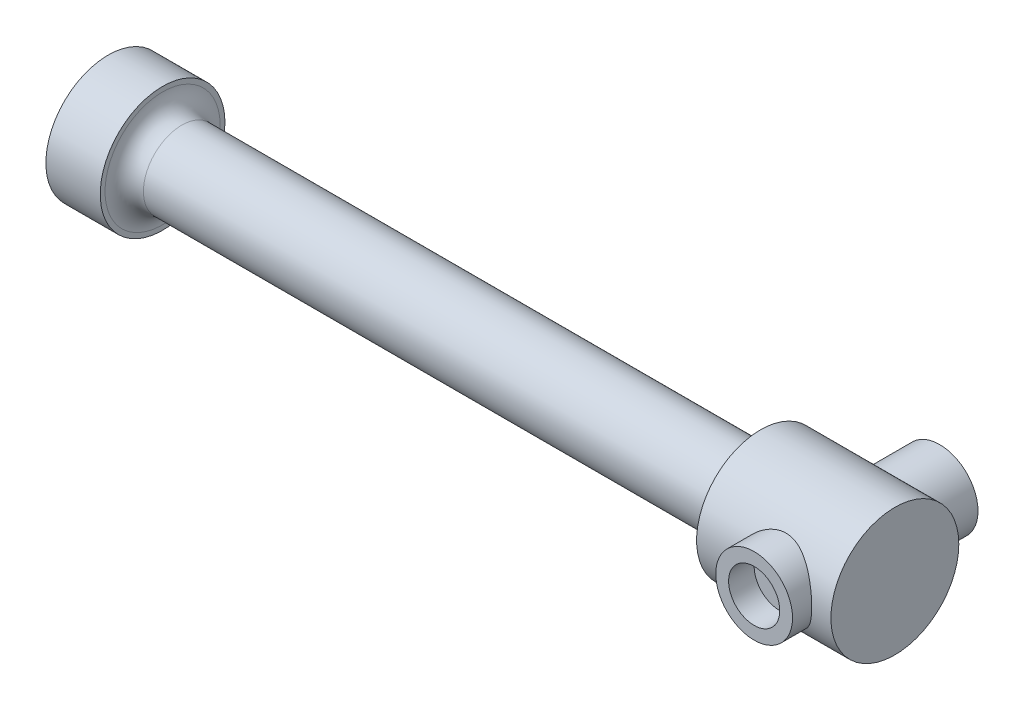
ISO-10303-21;
HEADER;
FILE_DESCRIPTION(('STEP AP214'),'2;1');
FILE_NAME('part.step','',(''),(''),'','','');
FILE_SCHEMA(('AUTOMOTIVE_DESIGN { 1 0 10303 214 1 1 1 1 }'));
ENDSEC;
DATA;
#1=APPLICATION_CONTEXT('core data for automotive mechanical design processes');
#2=APPLICATION_PROTOCOL_DEFINITION('international standard','automotive_design',2000,#1);
#3=PRODUCT_CONTEXT('',#1,'mechanical');
#4=PRODUCT('Part','Part','',(#3));
#5=PRODUCT_RELATED_PRODUCT_CATEGORY('part','',(#4));
#6=PRODUCT_DEFINITION_FORMATION('','',#4);
#7=PRODUCT_DEFINITION_CONTEXT('part definition',#1,'design');
#8=PRODUCT_DEFINITION('design','',#6,#7);
#9=PRODUCT_DEFINITION_SHAPE('','',#8);
#10=(LENGTH_UNIT() NAMED_UNIT(*) SI_UNIT(.MILLI.,.METRE.));
#11=(NAMED_UNIT(*) PLANE_ANGLE_UNIT() SI_UNIT($,.RADIAN.));
#12=(NAMED_UNIT(*) SI_UNIT($,.STERADIAN.) SOLID_ANGLE_UNIT());
#13=UNCERTAINTY_MEASURE_WITH_UNIT(LENGTH_MEASURE(1.E-05),#10,'distance_accuracy_value','');
#14=(GEOMETRIC_REPRESENTATION_CONTEXT(3) GLOBAL_UNCERTAINTY_ASSIGNED_CONTEXT((#13)) GLOBAL_UNIT_ASSIGNED_CONTEXT((#10,
#11,#12)) REPRESENTATION_CONTEXT('',''));
#15=CARTESIAN_POINT('',(0.,0.,0.));
#16=DIRECTION('',(0.,0.,1.));
#17=DIRECTION('',(1.,0.,0.));
#18=AXIS2_PLACEMENT_3D('',#15,#16,#17);
#19=CARTESIAN_POINT('',(114.,0.,-16.001));
#20=DIRECTION('',(0.,0.,1.));
#21=DIRECTION('',(1.,0.,0.));
#22=AXIS2_PLACEMENT_3D('',#19,#20,#21);
#23=CYLINDRICAL_SURFACE('',#22,1.5);
#24=CARTESIAN_POINT('',(114.,0.,9.));
#25=DIRECTION('',(0.,0.,1.));
#26=DIRECTION('',(1.,0.,0.));
#27=AXIS2_PLACEMENT_3D('',#24,#25,#26);
#28=CIRCLE('',#27,1.5);
#29=CARTESIAN_POINT('',(115.5,0.,9.));
#30=VERTEX_POINT('',#29);
#31=EDGE_CURVE('E285',#30,#30,#28,.T.);
#32=ORIENTED_EDGE('',*,*,#31,.T.);
#33=EDGE_LOOP('',(#32));
#34=FACE_BOUND('',#33,.T.);
#35=CARTESIAN_POINT('',(114.,0.,-12.));
#36=DIRECTION('',(0.,0.,-1.));
#37=DIRECTION('',(-1.,0.,0.));
#38=AXIS2_PLACEMENT_3D('',#35,#36,#37);
#39=CIRCLE('',#38,1.5);
#40=CARTESIAN_POINT('',(112.5,0.,-12.));
#41=VERTEX_POINT('',#40);
#42=EDGE_CURVE('E36',#41,#41,#39,.F.);
#43=ORIENTED_EDGE('',*,*,#42,.F.);
#44=EDGE_LOOP('',(#43));
#45=FACE_BOUND('',#44,.T.);
#46=ADVANCED_FACE('F32',(#34,#45),#23,.F.);
#47=CARTESIAN_POINT('',(8.5,0.,0.));
#48=DIRECTION('',(1.,0.,0.));
#49=DIRECTION('',(0.,0.,-1.));
#50=AXIS2_PLACEMENT_3D('',#47,#48,#49);
#51=PLANE('',#50);
#52=CARTESIAN_POINT('',(8.5,0.,0.));
#53=DIRECTION('',(1.,0.,0.));
#54=DIRECTION('',(0.,0.,-1.));
#55=AXIS2_PLACEMENT_3D('',#52,#53,#54);
#56=CIRCLE('',#55,9.);
#57=CARTESIAN_POINT('',(8.5,0.,-9.));
#58=VERTEX_POINT('',#57);
#59=EDGE_CURVE('E45',#58,#58,#56,.F.);
#60=ORIENTED_EDGE('',*,*,#59,.T.);
#61=EDGE_LOOP('',(#60));
#62=FACE_BOUND('',#61,.T.);
#63=CARTESIAN_POINT('',(8.5,0.,0.));
#64=DIRECTION('',(1.,0.,0.));
#65=DIRECTION('',(0.,0.,-1.));
#66=AXIS2_PLACEMENT_3D('',#63,#64,#65);
#67=CIRCLE('',#66,9.75);
#68=CARTESIAN_POINT('',(8.5,0.,-9.75));
#69=VERTEX_POINT('',#68);
#70=EDGE_CURVE('E141',#69,#69,#67,.T.);
#71=ORIENTED_EDGE('',*,*,#70,.T.);
#72=EDGE_LOOP('',(#71));
#73=FACE_BOUND('',#72,.T.);
#74=ADVANCED_FACE('F92',(#62,#73),#51,.T.);
#75=CARTESIAN_POINT('',(8.5,0.,0.));
#76=DIRECTION('',(-1.,0.,0.));
#77=DIRECTION('',(0.,0.,1.));
#78=AXIS2_PLACEMENT_3D('',#75,#76,#77);
#79=CYLINDRICAL_SURFACE('',#78,9.75);
#80=ORIENTED_EDGE('',*,*,#70,.F.);
#81=EDGE_LOOP('',(#80));
#82=FACE_BOUND('',#81,.T.);
#83=CARTESIAN_POINT('',(0.,0.,0.));
#84=DIRECTION('',(1.,0.,0.));
#85=DIRECTION('',(0.,0.,-1.));
#86=AXIS2_PLACEMENT_3D('',#83,#84,#85);
#87=CIRCLE('',#86,9.75);
#88=CARTESIAN_POINT('',(0.,0.,-9.75));
#89=VERTEX_POINT('',#88);
#90=EDGE_CURVE('E137',#89,#89,#87,.T.);
#91=ORIENTED_EDGE('',*,*,#90,.T.);
#92=EDGE_LOOP('',(#91));
#93=FACE_BOUND('',#92,.T.);
#94=ADVANCED_FACE('F98',(#82,#93),#79,.T.);
#95=CARTESIAN_POINT('',(0.,0.,0.));
#96=DIRECTION('',(1.,0.,0.));
#97=DIRECTION('',(0.,0.,-1.));
#98=AXIS2_PLACEMENT_3D('',#95,#96,#97);
#99=PLANE('',#98);
#100=ORIENTED_EDGE('',*,*,#90,.F.);
#101=EDGE_LOOP('',(#100));
#102=FACE_BOUND('',#101,.T.);
#103=ADVANCED_FACE('F155',(#102),#99,.F.);
#104=CARTESIAN_POINT('',(102.,0.,0.));
#105=DIRECTION('',(-1.,0.,0.));
#106=DIRECTION('',(0.,0.,1.));
#107=AXIS2_PLACEMENT_3D('',#104,#105,#106);
#108=CYLINDRICAL_SURFACE('',#107,6.);
#109=CARTESIAN_POINT('',(100.,0.,0.));
#110=DIRECTION('',(1.,0.,0.));
#111=DIRECTION('',(0.,0.,-1.));
#112=AXIS2_PLACEMENT_3D('',#109,#110,#111);
#113=CIRCLE('',#112,6.);
#114=CARTESIAN_POINT('',(100.,0.,-6.));
#115=VERTEX_POINT('',#114);
#116=EDGE_CURVE('E10',#115,#115,#113,.F.);
#117=ORIENTED_EDGE('',*,*,#116,.T.);
#118=EDGE_LOOP('',(#117));
#119=FACE_BOUND('',#118,.T.);
#120=CARTESIAN_POINT('',(11.5,0.,0.));
#121=DIRECTION('',(1.,0.,0.));
#122=DIRECTION('',(0.,0.,-1.));
#123=AXIS2_PLACEMENT_3D('',#120,#121,#122);
#124=CIRCLE('',#123,6.);
#125=CARTESIAN_POINT('',(11.5,0.,-6.));
#126=VERTEX_POINT('',#125);
#127=EDGE_CURVE('E144',#126,#126,#124,.T.);
#128=ORIENTED_EDGE('',*,*,#127,.T.);
#129=EDGE_LOOP('',(#128));
#130=FACE_BOUND('',#129,.T.);
#131=ADVANCED_FACE('F88',(#119,#130),#108,.T.);
#132=CARTESIAN_POINT('',(11.5,0.,0.));
#133=DIRECTION('',(1.,0.,0.));
#134=DIRECTION('',(0.,0.,-1.));
#135=AXIS2_PLACEMENT_3D('',#132,#133,#134);
#136=TOROIDAL_SURFACE('',#135,9.,3.);
#137=ORIENTED_EDGE('',*,*,#59,.F.);
#138=EDGE_LOOP('',(#137));
#139=FACE_BOUND('',#138,.T.);
#140=ORIENTED_EDGE('',*,*,#127,.F.);
#141=EDGE_LOOP('',(#140));
#142=FACE_BOUND('',#141,.T.);
#143=ADVANCED_FACE('F81',(#139,#142),#136,.F.);
#144=CARTESIAN_POINT('',(102.,0.,0.));
#145=DIRECTION('',(1.,0.,0.));
#146=DIRECTION('',(0.,0.,-1.));
#147=AXIS2_PLACEMENT_3D('',#144,#145,#146);
#148=PLANE('',#147);
#149=CARTESIAN_POINT('',(102.,0.,0.));
#150=DIRECTION('',(1.,0.,0.));
#151=DIRECTION('',(0.,0.,-1.));
#152=AXIS2_PLACEMENT_3D('',#149,#150,#151);
#153=CIRCLE('',#152,8.);
#154=CARTESIAN_POINT('',(102.,0.,-8.));
#155=VERTEX_POINT('',#154);
#156=EDGE_CURVE('E40',#155,#155,#153,.T.);
#157=ORIENTED_EDGE('',*,*,#156,.T.);
#158=EDGE_LOOP('',(#157));
#159=FACE_BOUND('',#158,.T.);
#160=CARTESIAN_POINT('',(102.,0.,0.));
#161=DIRECTION('',(1.,0.,0.));
#162=DIRECTION('',(0.,0.,-1.));
#163=AXIS2_PLACEMENT_3D('',#160,#161,#162);
#164=CIRCLE('',#163,10.);
#165=CARTESIAN_POINT('',(102.,0.,-10.));
#166=VERTEX_POINT('',#165);
#167=EDGE_CURVE('E138',#166,#166,#164,.T.);
#168=ORIENTED_EDGE('',*,*,#167,.F.);
#169=EDGE_LOOP('',(#168));
#170=FACE_BOUND('',#169,.T.);
#171=ADVANCED_FACE('F79',(#159,#170),#148,.F.);
#172=CARTESIAN_POINT('',(123.,0.,0.));
#173=DIRECTION('',(-1.,0.,0.));
#174=DIRECTION('',(0.,0.,1.));
#175=AXIS2_PLACEMENT_3D('',#172,#173,#174);
#176=CYLINDRICAL_SURFACE('',#175,10.);
#177=CARTESIAN_POINT('',(120.,0.,10.));
#178=CARTESIAN_POINT('',(119.999998745191,-0.153537444551437,9.99999883168644));
#179=CARTESIAN_POINT('',(119.9940973574,-0.307113729394928,9.99645496091162));
#180=CARTESIAN_POINT('',(119.970566986841,-0.613107521326879,9.98236364463673));
#181=CARTESIAN_POINT('',(119.952931142188,-0.76552429760002,9.97181210130936));
#182=CARTESIAN_POINT('',(119.906127895651,-1.06824745150987,9.94394249918953));
#183=CARTESIAN_POINT('',(119.876938661774,-1.21854927251923,9.926611630499));
#184=CARTESIAN_POINT('',(119.807400061742,-1.51572002727398,9.88560105277181));
#185=CARTESIAN_POINT('',(119.767045930178,-1.66258746605991,9.86191863289495));
#186=CARTESIAN_POINT('',(119.675912399103,-1.95109561530948,9.80890481966906));
#187=CARTESIAN_POINT('',(119.62519085957,-2.09276039690219,9.77960483164848));
#188=CARTESIAN_POINT('',(119.513725630889,-2.37093083799643,9.7159192851634));
#189=CARTESIAN_POINT('',(119.452978069542,-2.50743447905545,9.68153176235135));
#190=CARTESIAN_POINT('',(119.256615921481,-2.90796291658618,9.57184162303338));
#191=CARTESIAN_POINT('',(119.106765140666,-3.1633697760085,9.4899416782257));
#192=CARTESIAN_POINT('',(118.760891856919,-3.66523770071095,9.30821070093225));
#193=CARTESIAN_POINT('',(118.562214867513,-3.90952112480153,9.20748739861886));
#194=CARTESIAN_POINT('',(118.130101497822,-4.36354579042122,9.00120183744764));
#195=CARTESIAN_POINT('',(117.896620567373,-4.57324202374219,8.89563349844521));
#196=CARTESIAN_POINT('',(117.508001002179,-4.87082578782842,8.73441166956493));
#197=CARTESIAN_POINT('',(117.363367381755,-4.97182330842635,8.67715724472595));
#198=CARTESIAN_POINT('',(117.064805642624,-5.16122122731058,8.56585317782531));
#199=CARTESIAN_POINT('',(116.910875994797,-5.24961954505302,8.511804065925));
#200=CARTESIAN_POINT('',(116.594622317587,-5.41290775237596,8.40890843735161));
#201=CARTESIAN_POINT('',(116.432309612332,-5.48781528185459,8.36005516160798));
#202=CARTESIAN_POINT('',(116.099941829181,-5.62338163354011,8.26947589323735));
#203=CARTESIAN_POINT('',(115.929889668991,-5.68404577312335,8.22774724242061));
#204=CARTESIAN_POINT('',(115.625079920862,-5.77737221892758,8.16237611554734));
#205=CARTESIAN_POINT('',(115.491716651134,-5.8132588951073,8.13679954295732));
#206=CARTESIAN_POINT('',(115.221870482181,-5.87590039350671,8.09168021123358));
#207=CARTESIAN_POINT('',(115.085388281244,-5.90265723881365,8.07213611544971));
#208=CARTESIAN_POINT('',(114.810251714021,-5.94666970539668,8.03976789878061));
#209=CARTESIAN_POINT('',(114.671599731358,-5.9639350903157,8.02693687297642));
#210=CARTESIAN_POINT('',(114.392944984699,-5.9887526638035,8.00843825390027));
#211=CARTESIAN_POINT('',(114.252942197494,-5.99630468517717,8.00277078393386));
#212=CARTESIAN_POINT('',(113.972369514264,-6.00157990771218,7.99881555301096));
#213=CARTESIAN_POINT('',(113.831799044393,-5.99928372966397,8.00054234240933));
#214=CARTESIAN_POINT('',(113.551452631554,-5.98485668610316,8.01134007353734));
#215=CARTESIAN_POINT('',(113.41167669245,-5.97272577280601,8.02041105095058));
#216=CARTESIAN_POINT('',(113.133876805591,-5.93880584038254,8.04555965197211));
#217=CARTESIAN_POINT('',(112.995853676696,-5.91701246647433,8.06164043478003));
#218=CARTESIAN_POINT('',(112.722505408924,-5.86407894147697,8.10022471868288));
#219=CARTESIAN_POINT('',(112.587181396816,-5.83293497053064,8.12273084444056));
#220=CARTESIAN_POINT('',(112.190039218444,-5.7269806380151,8.19812127089691));
#221=CARTESIAN_POINT('',(111.933129362913,-5.63915194131273,8.25926888138427));
#222=CARTESIAN_POINT('',(111.437182443319,-5.43180047493028,8.39708163578851));
#223=CARTESIAN_POINT('',(111.19815197252,-5.31226608650176,8.47375246584326));
#224=CARTESIAN_POINT('',(110.700051973396,-5.02070076963739,8.65022234735539));
#225=CARTESIAN_POINT('',(110.444785119534,-4.84314550121072,8.75172142070218));
#226=CARTESIAN_POINT('',(110.085230823983,-4.54957124280612,8.90582410728344));
#227=CARTESIAN_POINT('',(109.969189776868,-4.44708318574261,8.95754136048025));
#228=CARTESIAN_POINT('',(109.745217586189,-4.23329437801549,9.06053415675082));
#229=CARTESIAN_POINT('',(109.637287889964,-4.12199206183187,9.11180961955592));
#230=CARTESIAN_POINT('',(109.415562196611,-3.87481857478412,9.21989326570381));
#231=CARTESIAN_POINT('',(109.303055390159,-3.73768795265441,9.27647282365172));
#232=CARTESIAN_POINT('',(109.090073335409,-3.45314122942453,9.38610941141658));
#233=CARTESIAN_POINT('',(108.989593417424,-3.30572915572596,9.43916780480959));
#234=CARTESIAN_POINT('',(108.801519489967,-3.00130059968161,9.54033102133581));
#235=CARTESIAN_POINT('',(108.713923953926,-2.84428525827774,9.58843643110623));
#236=CARTESIAN_POINT('',(108.552589758162,-2.52155783578282,9.67831544597726));
#237=CARTESIAN_POINT('',(108.47884937857,-2.35584683737316,9.72008983683586));
#238=CARTESIAN_POINT('',(108.350395779526,-2.02757278212966,9.79364255267099));
#239=CARTESIAN_POINT('',(108.294776852394,-1.86546851518059,9.82588466787389));
#240=CARTESIAN_POINT('',(108.197354045748,-1.53584722067878,9.88276955471718));
#241=CARTESIAN_POINT('',(108.15554976973,-1.36833034862805,9.90741254446339));
#242=CARTESIAN_POINT('',(108.086455507211,-1.02949369065076,9.94832818480364));
#243=CARTESIAN_POINT('',(108.059151054434,-0.858177873374311,9.96460917751309));
#244=CARTESIAN_POINT('',(108.01947106463,-0.513226306032294,9.9883166876579));
#245=CARTESIAN_POINT('',(108.007093427881,-0.339590885735249,9.99574445045558));
#246=CARTESIAN_POINT('',(107.998136179932,-0.015428594246427,10.0011181661532));
#247=CARTESIAN_POINT('',(107.999637405943,0.135030316693078,10.0002160020556));
#248=CARTESIAN_POINT('',(108.013919562041,0.435218261170644,9.99165275901541));
#249=CARTESIAN_POINT('',(108.026700120559,0.584947318588576,9.98399190272153));
#250=CARTESIAN_POINT('',(108.063367363032,0.882536056591296,9.96209775285793));
#251=CARTESIAN_POINT('',(108.087253288556,1.03039586412686,9.94786490811761));
#252=CARTESIAN_POINT('',(108.145821548111,1.32321247217726,9.913165472997));
#253=CARTESIAN_POINT('',(108.180504150208,1.46816920051815,9.89269872783916));
#254=CARTESIAN_POINT('',(108.259272160967,1.75071908629022,9.84657104453397));
#255=CARTESIAN_POINT('',(108.303105141372,1.88840566825772,9.82105034214295));
#256=CARTESIAN_POINT('',(108.400198532975,2.15939029274506,9.76505054291718));
#257=CARTESIAN_POINT('',(108.453461981776,2.29268690477589,9.73456984870001));
#258=CARTESIAN_POINT('',(108.626663243989,2.6849253601121,9.6365771020272));
#259=CARTESIAN_POINT('',(108.760070479651,2.93642286384019,9.56247925125989));
#260=CARTESIAN_POINT('',(109.074235119669,3.44006129431898,9.39381699318939));
#261=CARTESIAN_POINT('',(109.258469262826,3.6895614151548,9.29792673244944));
#262=CARTESIAN_POINT('',(109.66159165795,4.15611932969619,9.09895598301211));
#263=CARTESIAN_POINT('',(109.880520236191,4.37313879233219,8.99586720626164));
#264=CARTESIAN_POINT('',(110.24723481991,4.68476192706762,8.83567180051124));
#265=CARTESIAN_POINT('',(110.384610416055,4.79158950335552,8.77804452474304));
#266=CARTESIAN_POINT('',(110.668777374529,4.99332637800022,8.66487441639237));
#267=CARTESIAN_POINT('',(110.81557115637,5.08823259511327,8.60933212529391));
#268=CARTESIAN_POINT('',(111.117846869394,5.26534568264162,8.50216742436207));
#269=CARTESIAN_POINT('',(111.273322897011,5.34756104251848,8.45054240595252));
#270=CARTESIAN_POINT('',(111.592308684127,5.49855628026275,8.35308038859148));
#271=CARTESIAN_POINT('',(111.755812655853,5.56734566466804,8.30723930239864));
#272=CARTESIAN_POINT('',(112.053963002338,5.67736385859907,8.23231224945508));
#273=CARTESIAN_POINT('',(112.187229386013,5.72133709184488,8.20174483337219));
#274=CARTESIAN_POINT('',(112.457553736731,5.80005690886224,8.14626667510692));
#275=CARTESIAN_POINT('',(112.59460966938,5.83480834103845,8.12135296146618));
#276=CARTESIAN_POINT('',(112.871688404292,5.8946568885387,8.07801879862436));
#277=CARTESIAN_POINT('',(113.011708139346,5.91976351478428,8.05959195410913));
#278=CARTESIAN_POINT('',(113.293932521359,5.9600153732825,8.02987210085862));
#279=CARTESIAN_POINT('',(113.436137181068,5.97516054737435,8.01857913377509));
#280=CARTESIAN_POINT('',(113.722213824173,5.99528753337017,8.0035422228399));
#281=CARTESIAN_POINT('',(113.866090097559,6.00023037231476,7.999827227501));
#282=CARTESIAN_POINT('',(114.153815740271,5.99975311757475,8.00018515536029));
#283=CARTESIAN_POINT('',(114.29766510955,5.99433300567701,8.00425809224595));
#284=CARTESIAN_POINT('',(114.584248956659,5.97321593242882,8.02002886262284));
#285=CARTESIAN_POINT('',(114.726982871581,5.9575140835971,8.03173032236349));
#286=CARTESIAN_POINT('',(115.010198154241,5.91607855231599,8.06229956209071));
#287=CARTESIAN_POINT('',(115.150679512675,5.89034482844307,8.08116737166849));
#288=CARTESIAN_POINT('',(115.42172585741,5.83069515235667,8.12430163249588));
#289=CARTESIAN_POINT('',(115.552441159206,5.79723709119027,8.14826151524265));
#290=CARTESIAN_POINT('',(115.810385741413,5.72193802024643,8.2013135481482));
#291=CARTESIAN_POINT('',(115.937613829714,5.68009418342385,8.23040742870394));
#292=CARTESIAN_POINT('',(116.31322746154,5.54256357829889,8.32420030637917));
#293=CARTESIAN_POINT('',(116.555679953471,5.43484692597259,8.39543383966226));
#294=CARTESIAN_POINT('',(117.057312736404,5.17156568978209,8.56052345401851));
#295=CARTESIAN_POINT('',(117.313346125629,5.01119401055784,8.6561736985039));
#296=CARTESIAN_POINT('',(117.797538595375,4.65500060946757,8.85281489413667));
#297=CARTESIAN_POINT('',(118.025674461098,4.45914969547372,8.95381019436587));
#298=CARTESIAN_POINT('',(118.36183660388,4.12370341470835,9.11118672816113));
#299=CARTESIAN_POINT('',(118.48022504267,3.9947869496437,9.16858001952611));
#300=CARTESIAN_POINT('',(118.705753497502,3.72646931290711,9.28086988407214));
#301=CARTESIAN_POINT('',(118.812896949807,3.58707136666572,9.3357672170491));
#302=CARTESIAN_POINT('',(119.015218004567,3.29828675494298,9.44166188164684));
#303=CARTESIAN_POINT('',(119.110387078295,3.14889308474009,9.49265642349905));
#304=CARTESIAN_POINT('',(119.287766851204,2.84096458145434,9.58931425936429));
#305=CARTESIAN_POINT('',(119.369979172956,2.68243089637472,9.63497822073852));
#306=CARTESIAN_POINT('',(119.518207155826,2.36211349400593,9.71838319081371));
#307=CARTESIAN_POINT('',(119.584638495226,2.20057425723904,9.75632252421503));
#308=CARTESIAN_POINT('',(119.703530953194,1.87094026552715,9.82486154361095));
#309=CARTESIAN_POINT('',(119.75599475181,1.70284677529883,9.85546263753239));
#310=CARTESIAN_POINT('',(119.846016943351,1.36200638705991,9.90830915235697));
#311=CARTESIAN_POINT('',(119.883621672215,1.18927577776316,9.93058053649489));
#312=CARTESIAN_POINT('',(119.943489192635,0.840366716144949,9.96616672075865));
#313=CARTESIAN_POINT('',(119.965764761897,0.664191261592111,9.97948898025471));
#314=CARTESIAN_POINT('',(119.986783372373,0.406248020354684,9.99207457493582));
#315=CARTESIAN_POINT('',(119.991736975677,0.325112869232335,9.99504405536016));
#316=CARTESIAN_POINT('',(119.998345679055,0.16265544935751,9.99900711160739));
#317=CARTESIAN_POINT('',(120.000000664708,0.0813331742121601,10.0000006188891));
#318=CARTESIAN_POINT('',(120.,0.,10.));
#319=B_SPLINE_CURVE_WITH_KNOTS('',3,(#177,#178,#179,#180,#181,#182,#183,#184,#185,#186,#187,
#188,#189,#190,#191,#192,#193,#194,#195,#196,#197,#198,#199,#200,#201,#202,#203,#204,#205,#206,
#207,#208,#209,#210,#211,#212,#213,#214,#215,#216,#217,#218,#219,#220,#221,#222,#223,#224,#225,
#226,#227,#228,#229,#230,#231,#232,#233,#234,#235,#236,#237,#238,#239,#240,#241,#242,#243,#244,
#245,#246,#247,#248,#249,#250,#251,#252,#253,#254,#255,#256,#257,#258,#259,#260,#261,#262,#263,
#264,#265,#266,#267,#268,#269,#270,#271,#272,#273,#274,#275,#276,#277,#278,#279,#280,#281,#282,
#283,#284,#285,#286,#287,#288,#289,#290,#291,#292,#293,#294,#295,#296,#297,#298,#299,#300,#301,
#302,#303,#304,#305,#306,#307,#308,#309,#310,#311,#312,#313,#314,#315,#316,#317,#318),
.UNSPECIFIED.,.T.,.F.,(4,2,2,2,2,2,2,2,2,2,2,2,2,2,2,2,2,2,2,2,2,2,2,2,2,2,2,2,2,2,2,2,2,2,2,2,
2,2,2,2,2,2,2,2,2,2,2,2,2,2,2,2,2,2,2,2,2,2,2,2,2,2,2,2,2,2,2,2,2,2,4),(0.,0.460526601189237,
0.921322738666801,1.38299381403058,1.84486224490669,2.30422013956031,2.76375586197537,
3.68167311554442,4.66978395284543,5.65917064091952,6.21499415637781,6.77090935054834,
7.32609229452149,7.88106764554409,8.30201487574484,8.72286876721018,9.14328892216057,
9.56371631366181,9.98497139806241,10.40622852925,10.8276757104407,11.2492952938386,
12.0807558666506,12.9125215553463,13.8897049719634,14.3790534646455,14.8684890673691,
15.4263461011955,15.983985828052,16.5415594312421,17.0990637758594,17.6214641151699,
18.1438494594443,18.6657126431692,19.1875024090024,19.638346895262,20.0891765301004,
20.5399753803935,20.9907854241961,21.4305002375878,21.8703569439357,22.7494233427058,
23.7197001490793,24.6911131196182,25.2405264723239,25.7900815377537,26.3392673739261,
26.8880629256888,27.3185187217206,27.7487477532128,28.1785514321197,28.6083576204496,
29.0398026540948,29.4712484460159,29.9028994771413,30.3345522906549,30.7452488920627,
31.156084182716,31.9773303104338,32.9246646516038,33.8727820243207,34.4248169890477,
34.9766827677429,35.5289394130232,36.0811268442984,36.6165634055116,37.1518971546363,
37.6855481107011,38.2187536985203,38.4626993445495,38.706653452248),.UNSPECIFIED.);
#320=CARTESIAN_POINT('',(120.,0.,10.));
#321=VERTEX_POINT('',#320);
#322=EDGE_CURVE('E56',#321,#321,#319,.T.);
#323=ORIENTED_EDGE('',*,*,#322,.T.);
#324=EDGE_LOOP('',(#323));
#325=FACE_BOUND('',#324,.T.);
#326=CARTESIAN_POINT('',(120.,0.,-10.));
#327=CARTESIAN_POINT('',(119.999998745191,0.153537444551437,-9.99999883168644));
#328=CARTESIAN_POINT('',(119.9940973574,0.307113729394929,-9.99645496091162));
#329=CARTESIAN_POINT('',(119.970566986841,0.613107521326879,-9.98236364463673));
#330=CARTESIAN_POINT('',(119.952931142188,0.76552429760002,-9.97181210130936));
#331=CARTESIAN_POINT('',(119.906127895651,1.06824745150987,-9.94394249918953));
#332=CARTESIAN_POINT('',(119.876938661774,1.21854927251923,-9.926611630499));
#333=CARTESIAN_POINT('',(119.807400061742,1.51572002727398,-9.88560105277181));
#334=CARTESIAN_POINT('',(119.767045930178,1.66258746605991,-9.86191863289495));
#335=CARTESIAN_POINT('',(119.675912399103,1.95109561530948,-9.80890481966906));
#336=CARTESIAN_POINT('',(119.62519085957,2.0927603969022,-9.77960483164847));
#337=CARTESIAN_POINT('',(119.513725630889,2.37093083799643,-9.7159192851634));
#338=CARTESIAN_POINT('',(119.452978069542,2.50743447905546,-9.68153176235135));
#339=CARTESIAN_POINT('',(119.256615921481,2.90796291658619,-9.57184162303337));
#340=CARTESIAN_POINT('',(119.106765140666,3.16336977600851,-9.48994167822569));
#341=CARTESIAN_POINT('',(118.760891856919,3.66523770071096,-9.30821070093225));
#342=CARTESIAN_POINT('',(118.562214867513,3.90952112480153,-9.20748739861886));
#343=CARTESIAN_POINT('',(118.130101497822,4.36354579042122,-9.00120183744764));
#344=CARTESIAN_POINT('',(117.896620567373,4.57324202374219,-8.89563349844521));
#345=CARTESIAN_POINT('',(117.508001002179,4.87082578782842,-8.73441166956493));
#346=CARTESIAN_POINT('',(117.363367381755,4.97182330842636,-8.67715724472595));
#347=CARTESIAN_POINT('',(117.064805642624,5.16122122731059,-8.56585317782531));
#348=CARTESIAN_POINT('',(116.910875994797,5.24961954505302,-8.51180406592499));
#349=CARTESIAN_POINT('',(116.594622317587,5.41290775237596,-8.40890843735162));
#350=CARTESIAN_POINT('',(116.432309612332,5.48781528185458,-8.36005516160798));
#351=CARTESIAN_POINT('',(116.099941829181,5.62338163354011,-8.26947589323735));
#352=CARTESIAN_POINT('',(115.929889668991,5.68404577312335,-8.22774724242061));
#353=CARTESIAN_POINT('',(115.625079920862,5.77737221892758,-8.16237611554734));
#354=CARTESIAN_POINT('',(115.491716651134,5.8132588951073,-8.13679954295732));
#355=CARTESIAN_POINT('',(115.221870482181,5.87590039350671,-8.09168021123358));
#356=CARTESIAN_POINT('',(115.085388281244,5.90265723881365,-8.07213611544971));
#357=CARTESIAN_POINT('',(114.810251714021,5.94666970539668,-8.03976789878061));
#358=CARTESIAN_POINT('',(114.671599731358,5.9639350903157,-8.02693687297642));
#359=CARTESIAN_POINT('',(114.392944984699,5.9887526638035,-8.00843825390027));
#360=CARTESIAN_POINT('',(114.252942197494,5.99630468517717,-8.00277078393386));
#361=CARTESIAN_POINT('',(113.972369514264,6.00157990771218,-7.99881555301096));
#362=CARTESIAN_POINT('',(113.831799044393,5.99928372966397,-8.00054234240933));
#363=CARTESIAN_POINT('',(113.551452631554,5.98485668610316,-8.01134007353734));
#364=CARTESIAN_POINT('',(113.41167669245,5.97272577280601,-8.02041105095058));
#365=CARTESIAN_POINT('',(113.133876805591,5.93880584038254,-8.04555965197211));
#366=CARTESIAN_POINT('',(112.995853676696,5.91701246647433,-8.06164043478003));
#367=CARTESIAN_POINT('',(112.722505408924,5.86407894147697,-8.10022471868288));
#368=CARTESIAN_POINT('',(112.587181396816,5.83293497053064,-8.12273084444056));
#369=CARTESIAN_POINT('',(112.190039218444,5.7269806380151,-8.19812127089691));
#370=CARTESIAN_POINT('',(111.933129362913,5.63915194131273,-8.25926888138427));
#371=CARTESIAN_POINT('',(111.437182443319,5.43180047493028,-8.39708163578851));
#372=CARTESIAN_POINT('',(111.19815197252,5.31226608650176,-8.47375246584326));
#373=CARTESIAN_POINT('',(110.700051973396,5.02070076963739,-8.65022234735539));
#374=CARTESIAN_POINT('',(110.444785119534,4.84314550121072,-8.75172142070218));
#375=CARTESIAN_POINT('',(110.085230823983,4.54957124280612,-8.90582410728344));
#376=CARTESIAN_POINT('',(109.969189776868,4.44708318574261,-8.95754136048025));
#377=CARTESIAN_POINT('',(109.745217586189,4.23329437801549,-9.06053415675082));
#378=CARTESIAN_POINT('',(109.637287889964,4.12199206183187,-9.11180961955592));
#379=CARTESIAN_POINT('',(109.415562196611,3.87481857478412,-9.21989326570381));
#380=CARTESIAN_POINT('',(109.303055390159,3.73768795265441,-9.27647282365172));
#381=CARTESIAN_POINT('',(109.090073335409,3.45314122942453,-9.38610941141658));
#382=CARTESIAN_POINT('',(108.989593417424,3.30572915572596,-9.43916780480959));
#383=CARTESIAN_POINT('',(108.801519489967,3.00130059968161,-9.54033102133581));
#384=CARTESIAN_POINT('',(108.713923953926,2.84428525827774,-9.58843643110622));
#385=CARTESIAN_POINT('',(108.552589758162,2.52155783578282,-9.67831544597726));
#386=CARTESIAN_POINT('',(108.47884937857,2.35584683737316,-9.72008983683586));
#387=CARTESIAN_POINT('',(108.350395779526,2.02757278212966,-9.79364255267099));
#388=CARTESIAN_POINT('',(108.294776852394,1.86546851518059,-9.82588466787389));
#389=CARTESIAN_POINT('',(108.197354045748,1.53584722067877,-9.88276955471718));
#390=CARTESIAN_POINT('',(108.15554976973,1.36833034862805,-9.90741254446339));
#391=CARTESIAN_POINT('',(108.086455507211,1.02949369065076,-9.94832818480364));
#392=CARTESIAN_POINT('',(108.059151054434,0.858177873374309,-9.96460917751309));
#393=CARTESIAN_POINT('',(108.01947106463,0.513226306032293,-9.9883166876579));
#394=CARTESIAN_POINT('',(108.007093427881,0.339590885735247,-9.99574445045557));
#395=CARTESIAN_POINT('',(107.998136179932,0.0154285942464256,-10.0011181661532));
#396=CARTESIAN_POINT('',(107.999637405943,-0.135030316693079,-10.0002160020556));
#397=CARTESIAN_POINT('',(108.013919562041,-0.435218261170645,-9.99165275901541));
#398=CARTESIAN_POINT('',(108.026700120559,-0.584947318588577,-9.98399190272153));
#399=CARTESIAN_POINT('',(108.063367363032,-0.882536056591297,-9.96209775285793));
#400=CARTESIAN_POINT('',(108.087253288556,-1.03039586412686,-9.94786490811761));
#401=CARTESIAN_POINT('',(108.145821548111,-1.32321247217726,-9.913165472997));
#402=CARTESIAN_POINT('',(108.180504150208,-1.46816920051815,-9.89269872783916));
#403=CARTESIAN_POINT('',(108.259272160967,-1.75071908629022,-9.84657104453397));
#404=CARTESIAN_POINT('',(108.303105141372,-1.88840566825772,-9.82105034214295));
#405=CARTESIAN_POINT('',(108.400198532975,-2.15939029274506,-9.76505054291718));
#406=CARTESIAN_POINT('',(108.453461981776,-2.29268690477589,-9.73456984870001));
#407=CARTESIAN_POINT('',(108.626663243989,-2.6849253601121,-9.6365771020272));
#408=CARTESIAN_POINT('',(108.760070479651,-2.93642286384019,-9.56247925125989));
#409=CARTESIAN_POINT('',(109.074235119669,-3.44006129431898,-9.39381699318939));
#410=CARTESIAN_POINT('',(109.258469262826,-3.6895614151548,-9.29792673244944));
#411=CARTESIAN_POINT('',(109.66159165795,-4.15611932969619,-9.09895598301211));
#412=CARTESIAN_POINT('',(109.880520236191,-4.37313879233219,-8.99586720626164));
#413=CARTESIAN_POINT('',(110.24723481991,-4.68476192706762,-8.83567180051124));
#414=CARTESIAN_POINT('',(110.384610416055,-4.79158950335552,-8.77804452474304));
#415=CARTESIAN_POINT('',(110.668777374529,-4.99332637800022,-8.66487441639237));
#416=CARTESIAN_POINT('',(110.81557115637,-5.08823259511327,-8.60933212529391));
#417=CARTESIAN_POINT('',(111.117846869394,-5.26534568264162,-8.50216742436207));
#418=CARTESIAN_POINT('',(111.273322897011,-5.34756104251848,-8.45054240595252));
#419=CARTESIAN_POINT('',(111.592308684127,-5.49855628026275,-8.35308038859149));
#420=CARTESIAN_POINT('',(111.755812655853,-5.56734566466804,-8.30723930239864));
#421=CARTESIAN_POINT('',(112.053963002338,-5.67736385859907,-8.23231224945508));
#422=CARTESIAN_POINT('',(112.187229386013,-5.72133709184488,-8.20174483337219));
#423=CARTESIAN_POINT('',(112.457553736731,-5.80005690886224,-8.14626667510693));
#424=CARTESIAN_POINT('',(112.59460966938,-5.83480834103845,-8.12135296146618));
#425=CARTESIAN_POINT('',(112.871688404292,-5.8946568885387,-8.07801879862436));
#426=CARTESIAN_POINT('',(113.011708139346,-5.91976351478428,-8.05959195410913));
#427=CARTESIAN_POINT('',(113.293932521359,-5.9600153732825,-8.02987210085862));
#428=CARTESIAN_POINT('',(113.436137181068,-5.97516054737435,-8.01857913377509));
#429=CARTESIAN_POINT('',(113.722213824173,-5.99528753337017,-8.0035422228399));
#430=CARTESIAN_POINT('',(113.866090097559,-6.00023037231476,-7.999827227501));
#431=CARTESIAN_POINT('',(114.153815740271,-5.99975311757475,-8.00018515536029));
#432=CARTESIAN_POINT('',(114.29766510955,-5.99433300567701,-8.00425809224595));
#433=CARTESIAN_POINT('',(114.584248956659,-5.97321593242882,-8.02002886262284));
#434=CARTESIAN_POINT('',(114.726982871581,-5.9575140835971,-8.03173032236349));
#435=CARTESIAN_POINT('',(115.010198154241,-5.91607855231599,-8.06229956209071));
#436=CARTESIAN_POINT('',(115.150679512675,-5.89034482844307,-8.08116737166849));
#437=CARTESIAN_POINT('',(115.42172585741,-5.83069515235667,-8.12430163249588));
#438=CARTESIAN_POINT('',(115.552441159206,-5.79723709119027,-8.14826151524265));
#439=CARTESIAN_POINT('',(115.810385741413,-5.72193802024643,-8.2013135481482));
#440=CARTESIAN_POINT('',(115.937613829714,-5.68009418342385,-8.23040742870394));
#441=CARTESIAN_POINT('',(116.31322746154,-5.54256357829889,-8.32420030637917));
#442=CARTESIAN_POINT('',(116.555679953471,-5.43484692597259,-8.39543383966226));
#443=CARTESIAN_POINT('',(117.057312736404,-5.17156568978209,-8.56052345401851));
#444=CARTESIAN_POINT('',(117.313346125629,-5.01119401055784,-8.6561736985039));
#445=CARTESIAN_POINT('',(117.797538595375,-4.65500060946757,-8.85281489413667));
#446=CARTESIAN_POINT('',(118.025674461098,-4.45914969547372,-8.95381019436587));
#447=CARTESIAN_POINT('',(118.36183660388,-4.12370341470835,-9.11118672816113));
#448=CARTESIAN_POINT('',(118.48022504267,-3.9947869496437,-9.16858001952611));
#449=CARTESIAN_POINT('',(118.705753497502,-3.72646931290711,-9.28086988407214));
#450=CARTESIAN_POINT('',(118.812896949807,-3.58707136666572,-9.3357672170491));
#451=CARTESIAN_POINT('',(119.015218004567,-3.29828675494298,-9.44166188164684));
#452=CARTESIAN_POINT('',(119.110387078295,-3.14889308474009,-9.49265642349905));
#453=CARTESIAN_POINT('',(119.287766851204,-2.84096458145434,-9.58931425936429));
#454=CARTESIAN_POINT('',(119.369979172956,-2.68243089637472,-9.63497822073852));
#455=CARTESIAN_POINT('',(119.518207155826,-2.36211349400593,-9.71838319081371));
#456=CARTESIAN_POINT('',(119.584638495226,-2.20057425723904,-9.75632252421502));
#457=CARTESIAN_POINT('',(119.703530953194,-1.87094026552716,-9.82486154361095));
#458=CARTESIAN_POINT('',(119.75599475181,-1.70284677529883,-9.85546263753239));
#459=CARTESIAN_POINT('',(119.846016943351,-1.36200638705992,-9.90830915235697));
#460=CARTESIAN_POINT('',(119.883621672215,-1.18927577776316,-9.93058053649488));
#461=CARTESIAN_POINT('',(119.943489192635,-0.84036671614495,-9.96616672075865));
#462=CARTESIAN_POINT('',(119.965764761897,-0.664191261592112,-9.97948898025471));
#463=CARTESIAN_POINT('',(119.986783372373,-0.406248020354685,-9.99207457493582));
#464=CARTESIAN_POINT('',(119.991736975677,-0.325112869232336,-9.99504405536016));
#465=CARTESIAN_POINT('',(119.998345679055,-0.16265544935751,-9.99900711160739));
#466=CARTESIAN_POINT('',(120.000000664708,-0.0813331742121603,-10.0000006188891));
#467=CARTESIAN_POINT('',(120.,0.,-10.));
#468=B_SPLINE_CURVE_WITH_KNOTS('',3,(#326,#327,#328,#329,#330,#331,#332,#333,#334,#335,#336,
#337,#338,#339,#340,#341,#342,#343,#344,#345,#346,#347,#348,#349,#350,#351,#352,#353,#354,#355,
#356,#357,#358,#359,#360,#361,#362,#363,#364,#365,#366,#367,#368,#369,#370,#371,#372,#373,#374,
#375,#376,#377,#378,#379,#380,#381,#382,#383,#384,#385,#386,#387,#388,#389,#390,#391,#392,#393,
#394,#395,#396,#397,#398,#399,#400,#401,#402,#403,#404,#405,#406,#407,#408,#409,#410,#411,#412,
#413,#414,#415,#416,#417,#418,#419,#420,#421,#422,#423,#424,#425,#426,#427,#428,#429,#430,#431,
#432,#433,#434,#435,#436,#437,#438,#439,#440,#441,#442,#443,#444,#445,#446,#447,#448,#449,#450,
#451,#452,#453,#454,#455,#456,#457,#458,#459,#460,#461,#462,#463,#464,#465,#466,#467),
.UNSPECIFIED.,.T.,.F.,(4,2,2,2,2,2,2,2,2,2,2,2,2,2,2,2,2,2,2,2,2,2,2,2,2,2,2,2,2,2,2,2,2,2,2,2,
2,2,2,2,2,2,2,2,2,2,2,2,2,2,2,2,2,2,2,2,2,2,2,2,2,2,2,2,2,2,2,2,2,2,4),(0.,0.460526601189237,
0.921322738666801,1.38299381403058,1.84486224490669,2.30422013956031,2.76375586197539,
3.68167311554442,4.66978395284543,5.65917064091951,6.21499415637784,6.77090935054834,
7.32609229452147,7.88106764554409,8.30201487574484,8.72286876721018,9.14328892216057,
9.5637163136618,9.9849713980624,10.40622852925,10.8276757104407,11.2492952938386,
12.0807558666506,12.9125215553463,13.8897049719634,14.3790534646455,14.8684890673691,
15.4263461011955,15.983985828052,16.5415594312421,17.0990637758594,17.6214641151699,
18.1438494594443,18.6657126431692,19.1875024090024,19.638346895262,20.0891765301004,
20.5399753803935,20.9907854241961,21.4305002375878,21.8703569439357,22.7494233427058,
23.7197001490793,24.6911131196182,25.2405264723239,25.7900815377537,26.3392673739261,
26.8880629256888,27.3185187217206,27.7487477532128,28.1785514321197,28.6083576204495,
29.0398026540948,29.4712484460159,29.9028994771413,30.3345522906548,30.7452488920627,
31.156084182716,31.9773303104338,32.9246646516038,33.8727820243207,34.4248169890476,
34.9766827677429,35.5289394130232,36.0811268442983,36.6165634055116,37.1518971546363,
37.6855481107011,38.2187536985203,38.4626993445495,38.706653452248),.UNSPECIFIED.);
#469=CARTESIAN_POINT('',(120.,0.,-10.));
#470=VERTEX_POINT('',#469);
#471=EDGE_CURVE('E49',#470,#470,#468,.T.);
#472=ORIENTED_EDGE('',*,*,#471,.T.);
#473=EDGE_LOOP('',(#472));
#474=FACE_BOUND('',#473,.T.);
#475=CARTESIAN_POINT('',(123.,0.,0.));
#476=DIRECTION('',(1.,0.,0.));
#477=DIRECTION('',(0.,0.,-1.));
#478=AXIS2_PLACEMENT_3D('',#475,#476,#477);
#479=CIRCLE('',#478,10.);
#480=CARTESIAN_POINT('',(123.,0.,-10.));
#481=VERTEX_POINT('',#480);
#482=EDGE_CURVE('E134',#481,#481,#479,.T.);
#483=ORIENTED_EDGE('',*,*,#482,.F.);
#484=EDGE_LOOP('',(#483));
#485=FACE_BOUND('',#484,.T.);
#486=ORIENTED_EDGE('',*,*,#167,.T.);
#487=EDGE_LOOP('',(#486));
#488=FACE_BOUND('',#487,.T.);
#489=ADVANCED_FACE('F61',(#325,#474,#485,#488),#176,.T.);
#490=CARTESIAN_POINT('',(123.,0.,0.));
#491=DIRECTION('',(1.,0.,0.));
#492=DIRECTION('',(0.,0.,-1.));
#493=AXIS2_PLACEMENT_3D('',#490,#491,#492);
#494=PLANE('',#493);
#495=ORIENTED_EDGE('',*,*,#482,.T.);
#496=EDGE_LOOP('',(#495));
#497=FACE_BOUND('',#496,.T.);
#498=ADVANCED_FACE('F75',(#497),#494,.T.);
#499=CARTESIAN_POINT('',(100.,0.,0.));
#500=DIRECTION('',(1.,0.,0.));
#501=DIRECTION('',(0.,0.,-1.));
#502=AXIS2_PLACEMENT_3D('',#499,#500,#501);
#503=TOROIDAL_SURFACE('',#502,8.,2.);
#504=ORIENTED_EDGE('',*,*,#116,.F.);
#505=EDGE_LOOP('',(#504));
#506=FACE_BOUND('',#505,.T.);
#507=ORIENTED_EDGE('',*,*,#156,.F.);
#508=EDGE_LOOP('',(#507));
#509=FACE_BOUND('',#508,.T.);
#510=ADVANCED_FACE('F34',(#506,#509),#503,.F.);
#511=CARTESIAN_POINT('',(114.,0.,-16.));
#512=DIRECTION('',(0.,0.,1.));
#513=DIRECTION('',(1.,0.,0.));
#514=AXIS2_PLACEMENT_3D('',#511,#512,#513);
#515=PLANE('',#514);
#516=CARTESIAN_POINT('',(114.,0.,-16.));
#517=DIRECTION('',(0.,0.,-1.));
#518=DIRECTION('',(-1.,0.,0.));
#519=AXIS2_PLACEMENT_3D('',#516,#517,#518);
#520=CIRCLE('',#519,4.00000000000001);
#521=CARTESIAN_POINT('',(110.,0.,-16.));
#522=VERTEX_POINT('',#521);
#523=EDGE_CURVE('E281',#522,#522,#520,.T.);
#524=ORIENTED_EDGE('',*,*,#523,.F.);
#525=EDGE_LOOP('',(#524));
#526=FACE_BOUND('',#525,.T.);
#527=CARTESIAN_POINT('',(114.,0.,-16.));
#528=DIRECTION('',(0.,0.,1.));
#529=DIRECTION('',(1.,0.,0.));
#530=AXIS2_PLACEMENT_3D('',#527,#528,#529);
#531=CIRCLE('',#530,6.);
#532=CARTESIAN_POINT('',(120.,0.,-16.));
#533=VERTEX_POINT('',#532);
#534=EDGE_CURVE('E57',#533,#533,#531,.T.);
#535=ORIENTED_EDGE('',*,*,#534,.F.);
#536=EDGE_LOOP('',(#535));
#537=FACE_BOUND('',#536,.T.);
#538=ADVANCED_FACE('F73',(#526,#537),#515,.F.);
#539=CARTESIAN_POINT('',(114.,0.,-16.));
#540=DIRECTION('',(0.,0.,1.));
#541=DIRECTION('',(1.,0.,0.));
#542=AXIS2_PLACEMENT_3D('',#539,#540,#541);
#543=CYLINDRICAL_SURFACE('',#542,6.);
#544=ORIENTED_EDGE('',*,*,#534,.T.);
#545=EDGE_LOOP('',(#544));
#546=FACE_BOUND('',#545,.T.);
#547=ORIENTED_EDGE('',*,*,#471,.F.);
#548=EDGE_LOOP('',(#547));
#549=FACE_BOUND('',#548,.T.);
#550=ADVANCED_FACE('F71',(#546,#549),#543,.T.);
#551=CARTESIAN_POINT('',(114.,0.,13.));
#552=DIRECTION('',(0.,0.,1.));
#553=DIRECTION('',(1.,0.,0.));
#554=AXIS2_PLACEMENT_3D('',#551,#552,#553);
#555=CIRCLE('',#554,6.);
#556=CARTESIAN_POINT('',(120.,0.,13.));
#557=VERTEX_POINT('',#556);
#558=EDGE_CURVE('E125',#557,#557,#555,.T.);
#559=ORIENTED_EDGE('',*,*,#558,.F.);
#560=EDGE_LOOP('',(#559));
#561=FACE_BOUND('',#560,.T.);
#562=ORIENTED_EDGE('',*,*,#322,.F.);
#563=EDGE_LOOP('',(#562));
#564=FACE_BOUND('',#563,.T.);
#565=ADVANCED_FACE('F65',(#561,#564),#543,.T.);
#566=CARTESIAN_POINT('',(114.,0.,13.));
#567=DIRECTION('',(0.,0.,1.));
#568=DIRECTION('',(1.,0.,0.));
#569=AXIS2_PLACEMENT_3D('',#566,#567,#568);
#570=PLANE('',#569);
#571=CARTESIAN_POINT('',(114.,0.,13.));
#572=DIRECTION('',(0.,0.,1.));
#573=DIRECTION('',(1.,0.,0.));
#574=AXIS2_PLACEMENT_3D('',#571,#572,#573);
#575=CIRCLE('',#574,4.00000000000001);
#576=CARTESIAN_POINT('',(118.,0.,13.));
#577=VERTEX_POINT('',#576);
#578=EDGE_CURVE('E122',#577,#577,#575,.T.);
#579=ORIENTED_EDGE('',*,*,#578,.F.);
#580=EDGE_LOOP('',(#579));
#581=FACE_BOUND('',#580,.T.);
#582=ORIENTED_EDGE('',*,*,#558,.T.);
#583=EDGE_LOOP('',(#582));
#584=FACE_BOUND('',#583,.T.);
#585=ADVANCED_FACE('F70',(#581,#584),#570,.T.);
#586=CARTESIAN_POINT('',(114.,0.,9.));
#587=DIRECTION('',(0.,0.,1.));
#588=DIRECTION('',(1.,0.,0.));
#589=AXIS2_PLACEMENT_3D('',#586,#587,#588);
#590=CYLINDRICAL_SURFACE('',#589,4.00000000000001);
#591=CARTESIAN_POINT('',(114.,0.,9.));
#592=DIRECTION('',(0.,0.,1.));
#593=DIRECTION('',(1.,0.,0.));
#594=AXIS2_PLACEMENT_3D('',#591,#592,#593);
#595=CIRCLE('',#594,4.00000000000001);
#596=CARTESIAN_POINT('',(118.,0.,9.));
#597=VERTEX_POINT('',#596);
#598=EDGE_CURVE('E126',#597,#597,#595,.T.);
#599=ORIENTED_EDGE('',*,*,#598,.F.);
#600=EDGE_LOOP('',(#599));
#601=FACE_BOUND('',#600,.T.);
#602=ORIENTED_EDGE('',*,*,#578,.T.);
#603=EDGE_LOOP('',(#602));
#604=FACE_BOUND('',#603,.T.);
#605=ADVANCED_FACE('F111',(#601,#604),#590,.F.);
#606=CARTESIAN_POINT('',(114.,0.,9.));
#607=DIRECTION('',(0.,0.,1.));
#608=DIRECTION('',(1.,0.,0.));
#609=AXIS2_PLACEMENT_3D('',#606,#607,#608);
#610=PLANE('',#609);
#611=ORIENTED_EDGE('',*,*,#31,.F.);
#612=EDGE_LOOP('',(#611));
#613=FACE_BOUND('',#612,.T.);
#614=ORIENTED_EDGE('',*,*,#598,.T.);
#615=EDGE_LOOP('',(#614));
#616=FACE_BOUND('',#615,.T.);
#617=ADVANCED_FACE('F107',(#613,#616),#610,.T.);
#618=CARTESIAN_POINT('',(114.,0.,-12.));
#619=DIRECTION('',(0.,0.,-1.));
#620=DIRECTION('',(-1.,0.,0.));
#621=AXIS2_PLACEMENT_3D('',#618,#619,#620);
#622=PLANE('',#621);
#623=CARTESIAN_POINT('',(114.,0.,-12.));
#624=DIRECTION('',(0.,0.,-1.));
#625=DIRECTION('',(-1.,0.,0.));
#626=AXIS2_PLACEMENT_3D('',#623,#624,#625);
#627=CIRCLE('',#626,4.00000000000001);
#628=CARTESIAN_POINT('',(110.,0.,-12.));
#629=VERTEX_POINT('',#628);
#630=EDGE_CURVE('E278',#629,#629,#627,.T.);
#631=ORIENTED_EDGE('',*,*,#630,.T.);
#632=EDGE_LOOP('',(#631));
#633=FACE_BOUND('',#632,.T.);
#634=ORIENTED_EDGE('',*,*,#42,.T.);
#635=EDGE_LOOP('',(#634));
#636=FACE_BOUND('',#635,.T.);
#637=ADVANCED_FACE('F110',(#633,#636),#622,.T.);
#638=CARTESIAN_POINT('',(114.,0.,-12.));
#639=DIRECTION('',(0.,0.,-1.));
#640=DIRECTION('',(-1.,0.,0.));
#641=AXIS2_PLACEMENT_3D('',#638,#639,#640);
#642=CYLINDRICAL_SURFACE('',#641,4.00000000000001);
#643=ORIENTED_EDGE('',*,*,#630,.F.);
#644=EDGE_LOOP('',(#643));
#645=FACE_BOUND('',#644,.T.);
#646=ORIENTED_EDGE('',*,*,#523,.T.);
#647=EDGE_LOOP('',(#646));
#648=FACE_BOUND('',#647,.T.);
#649=ADVANCED_FACE('F105',(#645,#648),#642,.F.);
#650=CLOSED_SHELL('',(#46,#74,#94,#103,#131,#143,#171,#489,#498,#510,#538,#550,#565,#585,#605,
#617,#637,#649));
#651=MANIFOLD_SOLID_BREP('B2',#650);
#652=ADVANCED_BREP_SHAPE_REPRESENTATION('',(#18,#651),#14);
#653=SHAPE_DEFINITION_REPRESENTATION(#9,#652);
ENDSEC;
END-ISO-10303-21;
